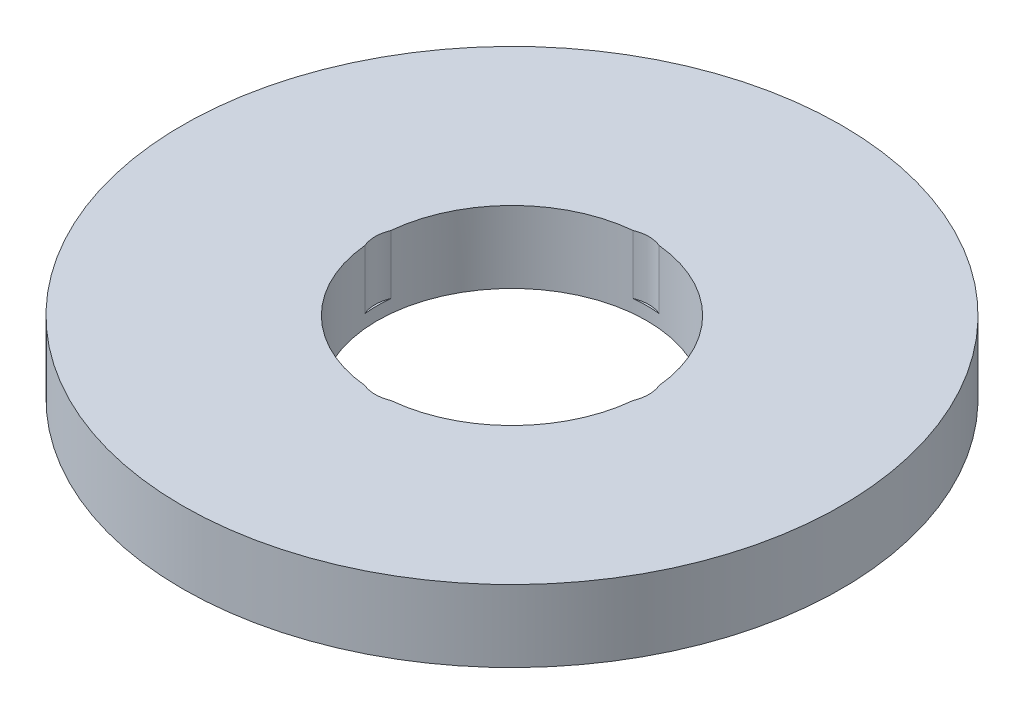
ISO-10303-21;
HEADER;
FILE_DESCRIPTION(('STEP AP214'),'2;1');
FILE_NAME('part.step','',(''),(''),'','','');
FILE_SCHEMA(('AUTOMOTIVE_DESIGN { 1 0 10303 214 1 1 1 1 }'));
ENDSEC;
DATA;
#1=APPLICATION_CONTEXT('core data for automotive mechanical design processes');
#2=APPLICATION_PROTOCOL_DEFINITION('international standard','automotive_design',2000,#1);
#3=PRODUCT_CONTEXT('',#1,'mechanical');
#4=PRODUCT('Part','Part','',(#3));
#5=PRODUCT_RELATED_PRODUCT_CATEGORY('part','',(#4));
#6=PRODUCT_DEFINITION_FORMATION('','',#4);
#7=PRODUCT_DEFINITION_CONTEXT('part definition',#1,'design');
#8=PRODUCT_DEFINITION('design','',#6,#7);
#9=PRODUCT_DEFINITION_SHAPE('','',#8);
#10=(LENGTH_UNIT() NAMED_UNIT(*) SI_UNIT(.MILLI.,.METRE.));
#11=(NAMED_UNIT(*) PLANE_ANGLE_UNIT() SI_UNIT($,.RADIAN.));
#12=(NAMED_UNIT(*) SI_UNIT($,.STERADIAN.) SOLID_ANGLE_UNIT());
#13=UNCERTAINTY_MEASURE_WITH_UNIT(LENGTH_MEASURE(1.E-05),#10,'distance_accuracy_value','');
#14=(GEOMETRIC_REPRESENTATION_CONTEXT(3) GLOBAL_UNCERTAINTY_ASSIGNED_CONTEXT((#13)) GLOBAL_UNIT_ASSIGNED_CONTEXT((#10,
#11,#12)) REPRESENTATION_CONTEXT('',''));
#15=CARTESIAN_POINT('',(0.,0.,0.));
#16=DIRECTION('',(0.,0.,1.));
#17=DIRECTION('',(1.,0.,0.));
#18=AXIS2_PLACEMENT_3D('',#15,#16,#17);
#19=CARTESIAN_POINT('',(0.,12.,0.));
#20=DIRECTION('',(0.,-1.,0.));
#21=DIRECTION('',(0.,0.,-1.));
#22=AXIS2_PLACEMENT_3D('',#19,#20,#21);
#23=CYLINDRICAL_SURFACE('',#22,55.);
#24=CARTESIAN_POINT('',(0.,12.,0.));
#25=DIRECTION('',(0.,1.,0.));
#26=DIRECTION('',(0.,0.,1.));
#27=AXIS2_PLACEMENT_3D('',#24,#25,#26);
#28=CIRCLE('',#27,55.);
#29=CARTESIAN_POINT('',(0.,12.,55.));
#30=VERTEX_POINT('',#29);
#31=EDGE_CURVE('E148',#30,#30,#28,.T.);
#32=ORIENTED_EDGE('',*,*,#31,.F.);
#33=EDGE_LOOP('',(#32));
#34=FACE_BOUND('',#33,.T.);
#35=CARTESIAN_POINT('',(0.,0.,0.));
#36=DIRECTION('',(0.,1.,0.));
#37=DIRECTION('',(0.,0.,1.));
#38=AXIS2_PLACEMENT_3D('',#35,#36,#37);
#39=CIRCLE('',#38,55.);
#40=CARTESIAN_POINT('',(0.,0.,55.));
#41=VERTEX_POINT('',#40);
#42=EDGE_CURVE('E139',#41,#41,#39,.T.);
#43=ORIENTED_EDGE('',*,*,#42,.T.);
#44=EDGE_LOOP('',(#43));
#45=FACE_BOUND('',#44,.T.);
#46=ADVANCED_FACE('F39',(#34,#45),#23,.T.);
#47=CARTESIAN_POINT('',(0.,12.,0.));
#48=DIRECTION('',(0.,1.,0.));
#49=DIRECTION('',(0.,0.,1.));
#50=AXIS2_PLACEMENT_3D('',#47,#48,#49);
#51=PLANE('',#50);
#52=CARTESIAN_POINT('',(0.,12.,17.2420460596062));
#53=DIRECTION('',(0.,1.,0.));
#54=DIRECTION('',(1.,0.,0.));
#55=AXIS2_PLACEMENT_3D('',#52,#53,#54);
#56=CIRCLE('',#55,5.58980980789785);
#57=CARTESIAN_POINT('',(-2.16489773256492,12.,22.3956071095993));
#58=VERTEX_POINT('',#57);
#59=CARTESIAN_POINT('',(2.16489773256508,12.,22.3956071095993));
#60=VERTEX_POINT('',#59);
#61=EDGE_CURVE('E175',#58,#60,#56,.T.);
#62=ORIENTED_EDGE('',*,*,#61,.F.);
#63=CARTESIAN_POINT('',(0.,12.,0.));
#64=DIRECTION('',(0.,1.,0.));
#65=DIRECTION('',(0.,0.,1.));
#66=AXIS2_PLACEMENT_3D('',#63,#64,#65);
#67=CIRCLE('',#66,22.5);
#68=CARTESIAN_POINT('',(-22.3956071095993,12.,2.164897732565));
#69=VERTEX_POINT('',#68);
#70=EDGE_CURVE('E134',#69,#58,#67,.T.);
#71=ORIENTED_EDGE('',*,*,#70,.F.);
#72=CARTESIAN_POINT('',(-17.2420460596062,12.,0.));
#73=DIRECTION('',(0.,1.,0.));
#74=DIRECTION('',(0.,0.,1.));
#75=AXIS2_PLACEMENT_3D('',#72,#73,#74);
#76=CIRCLE('',#75,5.58980980789785);
#77=CARTESIAN_POINT('',(-22.3956071095993,12.,-2.164897732565));
#78=VERTEX_POINT('',#77);
#79=EDGE_CURVE('E143',#78,#69,#76,.T.);
#80=ORIENTED_EDGE('',*,*,#79,.F.);
#81=CARTESIAN_POINT('',(-2.16489773256523,12.,-22.3956071095993));
#82=VERTEX_POINT('',#81);
#83=EDGE_CURVE('E123',#82,#78,#67,.T.);
#84=ORIENTED_EDGE('',*,*,#83,.F.);
#85=CARTESIAN_POINT('',(-1.80600846181767E-13,12.,-17.2420460596062));
#86=DIRECTION('',(0.,1.,0.));
#87=DIRECTION('',(-1.,0.,0.));
#88=AXIS2_PLACEMENT_3D('',#85,#86,#87);
#89=CIRCLE('',#88,5.58980980789785);
#90=CARTESIAN_POINT('',(2.16489773256476,12.,-22.3956071095993));
#91=VERTEX_POINT('',#90);
#92=EDGE_CURVE('E106',#91,#82,#89,.T.);
#93=ORIENTED_EDGE('',*,*,#92,.F.);
#94=CARTESIAN_POINT('',(22.3956071095993,12.,-2.164897732565));
#95=VERTEX_POINT('',#94);
#96=EDGE_CURVE('E125',#95,#91,#67,.T.);
#97=ORIENTED_EDGE('',*,*,#96,.F.);
#98=CARTESIAN_POINT('',(17.2420460596062,12.,0.));
#99=DIRECTION('',(0.,1.,0.));
#100=DIRECTION('',(0.,0.,-1.));
#101=AXIS2_PLACEMENT_3D('',#98,#99,#100);
#102=CIRCLE('',#101,5.58980980789785);
#103=CARTESIAN_POINT('',(22.3956071095993,12.,2.164897732565));
#104=VERTEX_POINT('',#103);
#105=EDGE_CURVE('E286',#104,#95,#102,.T.);
#106=ORIENTED_EDGE('',*,*,#105,.F.);
#107=EDGE_CURVE('E135',#60,#104,#67,.T.);
#108=ORIENTED_EDGE('',*,*,#107,.F.);
#109=EDGE_LOOP('',(#62,#71,#80,#84,#93,#97,#106,#108));
#110=FACE_BOUND('',#109,.T.);
#111=ORIENTED_EDGE('',*,*,#31,.T.);
#112=EDGE_LOOP('',(#111));
#113=FACE_BOUND('',#112,.T.);
#114=ADVANCED_FACE('F118',(#110,#113),#51,.T.);
#115=CARTESIAN_POINT('',(0.,0.,0.));
#116=DIRECTION('',(0.,1.,0.));
#117=DIRECTION('',(0.,0.,1.));
#118=AXIS2_PLACEMENT_3D('',#115,#116,#117);
#119=PLANE('',#118);
#120=CARTESIAN_POINT('',(0.,0.,0.));
#121=DIRECTION('',(0.,1.,0.));
#122=DIRECTION('',(0.,0.,1.));
#123=AXIS2_PLACEMENT_3D('',#120,#121,#122);
#124=CIRCLE('',#123,22.5);
#125=CARTESIAN_POINT('',(0.,0.,22.5));
#126=VERTEX_POINT('',#125);
#127=EDGE_CURVE('E136',#126,#126,#124,.T.);
#128=ORIENTED_EDGE('',*,*,#127,.T.);
#129=EDGE_LOOP('',(#128));
#130=FACE_BOUND('',#129,.T.);
#131=ORIENTED_EDGE('',*,*,#42,.F.);
#132=EDGE_LOOP('',(#131));
#133=FACE_BOUND('',#132,.T.);
#134=ADVANCED_FACE('F187',(#130,#133),#119,.F.);
#135=CARTESIAN_POINT('',(0.,12.,0.));
#136=DIRECTION('',(0.,-1.,0.));
#137=DIRECTION('',(0.,0.,-1.));
#138=AXIS2_PLACEMENT_3D('',#135,#136,#137);
#139=CYLINDRICAL_SURFACE('',#138,22.5);
#140=DIRECTION('',(0.,1.,0.));
#141=VECTOR('',#140,1.);
#142=CARTESIAN_POINT('',(-2.16489773256491,7.08353096851366,22.3956071095993));
#143=LINE('',#142,#141);
#144=CARTESIAN_POINT('',(-2.16489773256492,2.16706193702732,22.3956071095993));
#145=VERTEX_POINT('',#144);
#146=EDGE_CURVE('E11',#145,#58,#143,.T.);
#147=ORIENTED_EDGE('',*,*,#146,.F.);
#148=CARTESIAN_POINT('',(0.,2.16706193702732,0.));
#149=DIRECTION('',(0.,1.,0.));
#150=DIRECTION('',(0.,0.,1.));
#151=AXIS2_PLACEMENT_3D('',#148,#149,#150);
#152=CIRCLE('',#151,22.5);
#153=CARTESIAN_POINT('',(2.16489773256508,2.16706193702732,22.3956071095993));
#154=VERTEX_POINT('',#153);
#155=EDGE_CURVE('E170',#145,#154,#152,.T.);
#156=ORIENTED_EDGE('',*,*,#155,.T.);
#157=DIRECTION('',(0.,1.,0.));
#158=VECTOR('',#157,1.);
#159=CARTESIAN_POINT('',(2.16489773256507,7.08353096851366,22.3956071095993));
#160=LINE('',#159,#158);
#161=EDGE_CURVE('E46',#60,#154,#160,.F.);
#162=ORIENTED_EDGE('',*,*,#161,.F.);
#163=ORIENTED_EDGE('',*,*,#107,.T.);
#164=DIRECTION('',(0.,1.,0.));
#165=VECTOR('',#164,1.);
#166=CARTESIAN_POINT('',(22.3956071095993,7.08353096851366,2.16489773256499));
#167=LINE('',#166,#165);
#168=CARTESIAN_POINT('',(22.3956071095993,2.16706193702732,2.164897732565));
#169=VERTEX_POINT('',#168);
#170=EDGE_CURVE('E164',#169,#104,#167,.T.);
#171=ORIENTED_EDGE('',*,*,#170,.F.);
#172=CARTESIAN_POINT('',(0.,2.16706193702732,0.));
#173=DIRECTION('',(0.,1.,0.));
#174=DIRECTION('',(0.,0.,1.));
#175=AXIS2_PLACEMENT_3D('',#172,#173,#174);
#176=CIRCLE('',#175,22.5);
#177=CARTESIAN_POINT('',(22.3956071095993,2.16706193702732,-2.164897732565));
#178=VERTEX_POINT('',#177);
#179=EDGE_CURVE('E115',#169,#178,#176,.T.);
#180=ORIENTED_EDGE('',*,*,#179,.T.);
#181=DIRECTION('',(0.,1.,0.));
#182=VECTOR('',#181,1.);
#183=CARTESIAN_POINT('',(22.3956071095993,7.08353096851366,-2.16489773256499));
#184=LINE('',#183,#182);
#185=EDGE_CURVE('E131',#95,#178,#184,.F.);
#186=ORIENTED_EDGE('',*,*,#185,.F.);
#187=ORIENTED_EDGE('',*,*,#96,.T.);
#188=DIRECTION('',(0.,1.,0.));
#189=VECTOR('',#188,1.);
#190=CARTESIAN_POINT('',(2.16489773256476,7.08353096851366,-22.3956071095993));
#191=LINE('',#190,#189);
#192=CARTESIAN_POINT('',(2.16489773256476,2.16706193702732,-22.3956071095993));
#193=VERTEX_POINT('',#192);
#194=EDGE_CURVE('E105',#193,#91,#191,.T.);
#195=ORIENTED_EDGE('',*,*,#194,.F.);
#196=CARTESIAN_POINT('',(0.,2.16706193702732,0.));
#197=DIRECTION('',(0.,1.,0.));
#198=DIRECTION('',(0.,0.,1.));
#199=AXIS2_PLACEMENT_3D('',#196,#197,#198);
#200=CIRCLE('',#199,22.5);
#201=CARTESIAN_POINT('',(-2.16489773256523,2.16706193702732,-22.3956071095993));
#202=VERTEX_POINT('',#201);
#203=EDGE_CURVE('E159',#193,#202,#200,.T.);
#204=ORIENTED_EDGE('',*,*,#203,.T.);
#205=DIRECTION('',(0.,1.,0.));
#206=VECTOR('',#205,1.);
#207=CARTESIAN_POINT('',(-2.16489773256523,7.08353096851366,-22.3956071095993));
#208=LINE('',#207,#206);
#209=EDGE_CURVE('E114',#82,#202,#208,.F.);
#210=ORIENTED_EDGE('',*,*,#209,.F.);
#211=ORIENTED_EDGE('',*,*,#83,.T.);
#212=DIRECTION('',(0.,1.,0.));
#213=VECTOR('',#212,1.);
#214=CARTESIAN_POINT('',(-22.3956071095993,7.08353096851366,-2.16489773256499));
#215=LINE('',#214,#213);
#216=CARTESIAN_POINT('',(-22.3956071095993,2.16706193702732,-2.164897732565));
#217=VERTEX_POINT('',#216);
#218=EDGE_CURVE('E160',#217,#78,#215,.T.);
#219=ORIENTED_EDGE('',*,*,#218,.F.);
#220=CARTESIAN_POINT('',(0.,2.16706193702732,0.));
#221=DIRECTION('',(0.,1.,0.));
#222=DIRECTION('',(0.,0.,1.));
#223=AXIS2_PLACEMENT_3D('',#220,#221,#222);
#224=CIRCLE('',#223,22.5);
#225=CARTESIAN_POINT('',(-22.3956071095993,2.16706193702732,2.164897732565));
#226=VERTEX_POINT('',#225);
#227=EDGE_CURVE('E149',#217,#226,#224,.T.);
#228=ORIENTED_EDGE('',*,*,#227,.T.);
#229=DIRECTION('',(0.,1.,0.));
#230=VECTOR('',#229,1.);
#231=CARTESIAN_POINT('',(-22.3956071095993,7.08353096851366,2.16489773256499));
#232=LINE('',#231,#230);
#233=EDGE_CURVE('E152',#69,#226,#232,.F.);
#234=ORIENTED_EDGE('',*,*,#233,.F.);
#235=ORIENTED_EDGE('',*,*,#70,.T.);
#236=EDGE_LOOP('',(#147,#156,#162,#163,#171,#180,#186,#187,#195,#204,#210,#211,#219,#228,#234,#235));
#237=FACE_BOUND('',#236,.T.);
#238=ORIENTED_EDGE('',*,*,#127,.F.);
#239=EDGE_LOOP('',(#238));
#240=FACE_BOUND('',#239,.T.);
#241=ADVANCED_FACE('F126',(#237,#240),#139,.F.);
#242=CARTESIAN_POINT('',(-17.2420460596062,2.16706193702732,0.));
#243=DIRECTION('',(0.,1.,0.));
#244=DIRECTION('',(0.,0.,1.));
#245=AXIS2_PLACEMENT_3D('',#242,#243,#244);
#246=CYLINDRICAL_SURFACE('',#245,5.58980980789785);
#247=ORIENTED_EDGE('',*,*,#218,.T.);
#248=ORIENTED_EDGE('',*,*,#79,.T.);
#249=ORIENTED_EDGE('',*,*,#233,.T.);
#250=CARTESIAN_POINT('',(-17.2420460596062,2.16706193702732,0.));
#251=DIRECTION('',(0.,1.,0.));
#252=DIRECTION('',(0.,0.,1.));
#253=AXIS2_PLACEMENT_3D('',#250,#251,#252);
#254=CIRCLE('',#253,5.58980980789785);
#255=EDGE_CURVE('E144',#217,#226,#254,.T.);
#256=ORIENTED_EDGE('',*,*,#255,.F.);
#257=EDGE_LOOP('',(#247,#248,#249,#256));
#258=FACE_BOUND('',#257,.T.);
#259=ADVANCED_FACE('F200',(#258),#246,.F.);
#260=CARTESIAN_POINT('',(-17.2420460596062,2.16706193702732,0.));
#261=DIRECTION('',(0.,1.,0.));
#262=DIRECTION('',(0.,0.,1.));
#263=AXIS2_PLACEMENT_3D('',#260,#261,#262);
#264=PLANE('',#263);
#265=ORIENTED_EDGE('',*,*,#255,.T.);
#266=ORIENTED_EDGE('',*,*,#227,.F.);
#267=EDGE_LOOP('',(#265,#266));
#268=FACE_BOUND('',#267,.T.);
#269=ADVANCED_FACE('F201',(#268),#264,.T.);
#270=CARTESIAN_POINT('',(-1.80600846181767E-13,2.16706193702732,-17.2420460596062));
#271=DIRECTION('',(0.,1.,0.));
#272=DIRECTION('',(0.,0.,1.));
#273=AXIS2_PLACEMENT_3D('',#270,#271,#272);
#274=CYLINDRICAL_SURFACE('',#273,5.58980980789785);
#275=ORIENTED_EDGE('',*,*,#194,.T.);
#276=ORIENTED_EDGE('',*,*,#92,.T.);
#277=ORIENTED_EDGE('',*,*,#209,.T.);
#278=CARTESIAN_POINT('',(-1.80600846181767E-13,2.16706193702732,-17.2420460596062));
#279=DIRECTION('',(0.,1.,0.));
#280=DIRECTION('',(-1.,0.,0.));
#281=AXIS2_PLACEMENT_3D('',#278,#279,#280);
#282=CIRCLE('',#281,5.58980980789785);
#283=EDGE_CURVE('E107',#193,#202,#282,.T.);
#284=ORIENTED_EDGE('',*,*,#283,.F.);
#285=EDGE_LOOP('',(#275,#276,#277,#284));
#286=FACE_BOUND('',#285,.T.);
#287=ADVANCED_FACE('F102',(#286),#274,.F.);
#288=CARTESIAN_POINT('',(-1.80600846181767E-13,2.16706193702732,-17.2420460596062));
#289=DIRECTION('',(0.,1.,0.));
#290=DIRECTION('',(-1.,0.,0.));
#291=AXIS2_PLACEMENT_3D('',#288,#289,#290);
#292=PLANE('',#291);
#293=ORIENTED_EDGE('',*,*,#283,.T.);
#294=ORIENTED_EDGE('',*,*,#203,.F.);
#295=EDGE_LOOP('',(#293,#294));
#296=FACE_BOUND('',#295,.T.);
#297=ADVANCED_FACE('F209',(#296),#292,.T.);
#298=CARTESIAN_POINT('',(17.2420460596062,2.16706193702732,0.));
#299=DIRECTION('',(0.,1.,0.));
#300=DIRECTION('',(0.,0.,1.));
#301=AXIS2_PLACEMENT_3D('',#298,#299,#300);
#302=CYLINDRICAL_SURFACE('',#301,5.58980980789785);
#303=ORIENTED_EDGE('',*,*,#170,.T.);
#304=ORIENTED_EDGE('',*,*,#105,.T.);
#305=ORIENTED_EDGE('',*,*,#185,.T.);
#306=CARTESIAN_POINT('',(17.2420460596062,2.16706193702732,0.));
#307=DIRECTION('',(0.,1.,0.));
#308=DIRECTION('',(0.,0.,-1.));
#309=AXIS2_PLACEMENT_3D('',#306,#307,#308);
#310=CIRCLE('',#309,5.58980980789785);
#311=EDGE_CURVE('E56',#169,#178,#310,.T.);
#312=ORIENTED_EDGE('',*,*,#311,.F.);
#313=EDGE_LOOP('',(#303,#304,#305,#312));
#314=FACE_BOUND('',#313,.T.);
#315=ADVANCED_FACE('F213',(#314),#302,.F.);
#316=CARTESIAN_POINT('',(17.2420460596062,2.16706193702732,0.));
#317=DIRECTION('',(0.,1.,0.));
#318=DIRECTION('',(0.,0.,-1.));
#319=AXIS2_PLACEMENT_3D('',#316,#317,#318);
#320=PLANE('',#319);
#321=ORIENTED_EDGE('',*,*,#311,.T.);
#322=ORIENTED_EDGE('',*,*,#179,.F.);
#323=EDGE_LOOP('',(#321,#322));
#324=FACE_BOUND('',#323,.T.);
#325=ADVANCED_FACE('F179',(#324),#320,.T.);
#326=CARTESIAN_POINT('',(0.,2.16706193702732,17.2420460596062));
#327=DIRECTION('',(0.,1.,0.));
#328=DIRECTION('',(0.,0.,1.));
#329=AXIS2_PLACEMENT_3D('',#326,#327,#328);
#330=CYLINDRICAL_SURFACE('',#329,5.58980980789785);
#331=ORIENTED_EDGE('',*,*,#146,.T.);
#332=ORIENTED_EDGE('',*,*,#61,.T.);
#333=ORIENTED_EDGE('',*,*,#161,.T.);
#334=CARTESIAN_POINT('',(0.,2.16706193702732,17.2420460596062));
#335=DIRECTION('',(0.,1.,0.));
#336=DIRECTION('',(1.,0.,0.));
#337=AXIS2_PLACEMENT_3D('',#334,#335,#336);
#338=CIRCLE('',#337,5.58980980789785);
#339=EDGE_CURVE('E55',#145,#154,#338,.T.);
#340=ORIENTED_EDGE('',*,*,#339,.F.);
#341=EDGE_LOOP('',(#331,#332,#333,#340));
#342=FACE_BOUND('',#341,.T.);
#343=ADVANCED_FACE('F171',(#342),#330,.F.);
#344=CARTESIAN_POINT('',(0.,2.16706193702732,17.2420460596062));
#345=DIRECTION('',(0.,1.,0.));
#346=DIRECTION('',(1.,0.,0.));
#347=AXIS2_PLACEMENT_3D('',#344,#345,#346);
#348=PLANE('',#347);
#349=ORIENTED_EDGE('',*,*,#339,.T.);
#350=ORIENTED_EDGE('',*,*,#155,.F.);
#351=EDGE_LOOP('',(#349,#350));
#352=FACE_BOUND('',#351,.T.);
#353=ADVANCED_FACE('F173',(#352),#348,.T.);
#354=CLOSED_SHELL('',(#46,#114,#134,#241,#259,#269,#287,#297,#315,#325,#343,#353));
#355=MANIFOLD_SOLID_BREP('B2',#354);
#356=ADVANCED_BREP_SHAPE_REPRESENTATION('',(#18,#355),#14);
#357=SHAPE_DEFINITION_REPRESENTATION(#9,#356);
ENDSEC;
END-ISO-10303-21;
